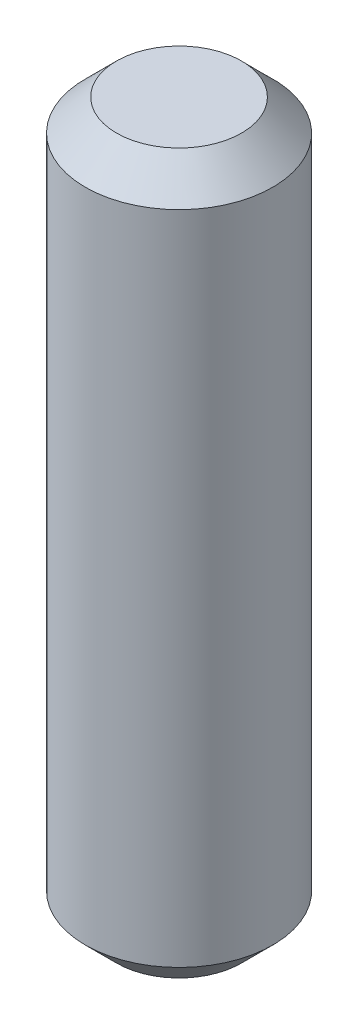
ISO-10303-21;
HEADER;
FILE_DESCRIPTION(('STEP AP214'),'2;1');
FILE_NAME('part.step','',(''),(''),'','','');
FILE_SCHEMA(('AUTOMOTIVE_DESIGN { 1 0 10303 214 1 1 1 1 }'));
ENDSEC;
DATA;
#1=APPLICATION_CONTEXT('core data for automotive mechanical design processes');
#2=APPLICATION_PROTOCOL_DEFINITION('international standard','automotive_design',2000,#1);
#3=PRODUCT_CONTEXT('',#1,'mechanical');
#4=PRODUCT('Part','Part','',(#3));
#5=PRODUCT_RELATED_PRODUCT_CATEGORY('part','',(#4));
#6=PRODUCT_DEFINITION_FORMATION('','',#4);
#7=PRODUCT_DEFINITION_CONTEXT('part definition',#1,'design');
#8=PRODUCT_DEFINITION('design','',#6,#7);
#9=PRODUCT_DEFINITION_SHAPE('','',#8);
#10=(LENGTH_UNIT() NAMED_UNIT(*) SI_UNIT(.MILLI.,.METRE.));
#11=(NAMED_UNIT(*) PLANE_ANGLE_UNIT() SI_UNIT($,.RADIAN.));
#12=(NAMED_UNIT(*) SI_UNIT($,.STERADIAN.) SOLID_ANGLE_UNIT());
#13=UNCERTAINTY_MEASURE_WITH_UNIT(LENGTH_MEASURE(1.E-05),#10,'distance_accuracy_value','');
#14=(GEOMETRIC_REPRESENTATION_CONTEXT(3) GLOBAL_UNCERTAINTY_ASSIGNED_CONTEXT((#13)) GLOBAL_UNIT_ASSIGNED_CONTEXT((#10,
#11,#12)) REPRESENTATION_CONTEXT('',''));
#15=CARTESIAN_POINT('',(0.,0.,0.));
#16=DIRECTION('',(0.,0.,1.));
#17=DIRECTION('',(1.,0.,0.));
#18=AXIS2_PLACEMENT_3D('',#15,#16,#17);
#19=CARTESIAN_POINT('',(0.,23.,0.));
#20=DIRECTION('',(0.,-1.,0.));
#21=DIRECTION('',(0.,0.,-1.));
#22=AXIS2_PLACEMENT_3D('',#19,#20,#21);
#23=CYLINDRICAL_SURFACE('',#22,3.);
#24=CARTESIAN_POINT('',(0.,22.,0.));
#25=DIRECTION('',(0.,1.,0.));
#26=DIRECTION('',(0.,0.,1.));
#27=AXIS2_PLACEMENT_3D('',#24,#25,#26);
#28=CIRCLE('',#27,3.);
#29=CARTESIAN_POINT('',(0.,22.,3.));
#30=VERTEX_POINT('',#29);
#31=EDGE_CURVE('E37',#30,#30,#28,.F.);
#32=ORIENTED_EDGE('',*,*,#31,.T.);
#33=EDGE_LOOP('',(#32));
#34=FACE_BOUND('',#33,.T.);
#35=CARTESIAN_POINT('',(0.,1.,0.));
#36=DIRECTION('',(0.,1.,0.));
#37=DIRECTION('',(0.,0.,1.));
#38=AXIS2_PLACEMENT_3D('',#35,#36,#37);
#39=CIRCLE('',#38,3.);
#40=CARTESIAN_POINT('',(0.,1.,3.));
#41=VERTEX_POINT('',#40);
#42=EDGE_CURVE('E41',#41,#41,#39,.T.);
#43=ORIENTED_EDGE('',*,*,#42,.T.);
#44=EDGE_LOOP('',(#43));
#45=FACE_BOUND('',#44,.T.);
#46=ADVANCED_FACE('F30',(#34,#45),#23,.T.);
#47=CARTESIAN_POINT('',(0.,23.,0.));
#48=DIRECTION('',(0.,1.,0.));
#49=DIRECTION('',(0.,0.,1.));
#50=AXIS2_PLACEMENT_3D('',#47,#48,#49);
#51=PLANE('',#50);
#52=CARTESIAN_POINT('',(0.,23.,0.));
#53=DIRECTION('',(0.,1.,0.));
#54=DIRECTION('',(0.,0.,1.));
#55=AXIS2_PLACEMENT_3D('',#52,#53,#54);
#56=CIRCLE('',#55,1.99999999999999);
#57=CARTESIAN_POINT('',(0.,23.,1.99999999999999));
#58=VERTEX_POINT('',#57);
#59=EDGE_CURVE('E45',#58,#58,#56,.T.);
#60=ORIENTED_EDGE('',*,*,#59,.T.);
#61=EDGE_LOOP('',(#60));
#62=FACE_BOUND('',#61,.T.);
#63=ADVANCED_FACE('F51',(#62),#51,.T.);
#64=CARTESIAN_POINT('',(0.,0.,0.));
#65=DIRECTION('',(0.,1.,0.));
#66=DIRECTION('',(0.,0.,1.));
#67=AXIS2_PLACEMENT_3D('',#64,#65,#66);
#68=PLANE('',#67);
#69=CARTESIAN_POINT('',(0.,0.,0.));
#70=DIRECTION('',(0.,1.,0.));
#71=DIRECTION('',(0.,0.,1.));
#72=AXIS2_PLACEMENT_3D('',#69,#70,#71);
#73=CIRCLE('',#72,2.);
#74=CARTESIAN_POINT('',(0.,0.,2.));
#75=VERTEX_POINT('',#74);
#76=EDGE_CURVE('E10',#75,#75,#73,.F.);
#77=ORIENTED_EDGE('',*,*,#76,.T.);
#78=EDGE_LOOP('',(#77));
#79=FACE_BOUND('',#78,.T.);
#80=ADVANCED_FACE('F55',(#79),#68,.F.);
#81=CARTESIAN_POINT('',(0.,23.,0.));
#82=DIRECTION('',(0.,-1.,0.));
#83=DIRECTION('',(0.,0.,-1.));
#84=AXIS2_PLACEMENT_3D('',#81,#82,#83);
#85=CONICAL_SURFACE('',#84,1.99999999999999,0.785398163397451);
#86=ORIENTED_EDGE('',*,*,#31,.F.);
#87=EDGE_LOOP('',(#86));
#88=FACE_BOUND('',#87,.T.);
#89=ORIENTED_EDGE('',*,*,#59,.F.);
#90=EDGE_LOOP('',(#89));
#91=FACE_BOUND('',#90,.T.);
#92=ADVANCED_FACE('F53',(#88,#91),#85,.T.);
#93=CARTESIAN_POINT('',(0.,1.,0.));
#94=DIRECTION('',(0.,1.,0.));
#95=DIRECTION('',(0.,0.,1.));
#96=AXIS2_PLACEMENT_3D('',#93,#94,#95);
#97=CONICAL_SURFACE('',#96,3.,0.785398163397449);
#98=ORIENTED_EDGE('',*,*,#76,.F.);
#99=EDGE_LOOP('',(#98));
#100=FACE_BOUND('',#99,.T.);
#101=ORIENTED_EDGE('',*,*,#42,.F.);
#102=EDGE_LOOP('',(#101));
#103=FACE_BOUND('',#102,.T.);
#104=ADVANCED_FACE('F32',(#100,#103),#97,.T.);
#105=CLOSED_SHELL('',(#46,#63,#80,#92,#104));
#106=MANIFOLD_SOLID_BREP('B2',#105);
#107=ADVANCED_BREP_SHAPE_REPRESENTATION('',(#18,#106),#14);
#108=SHAPE_DEFINITION_REPRESENTATION(#9,#107);
ENDSEC;
END-ISO-10303-21;
